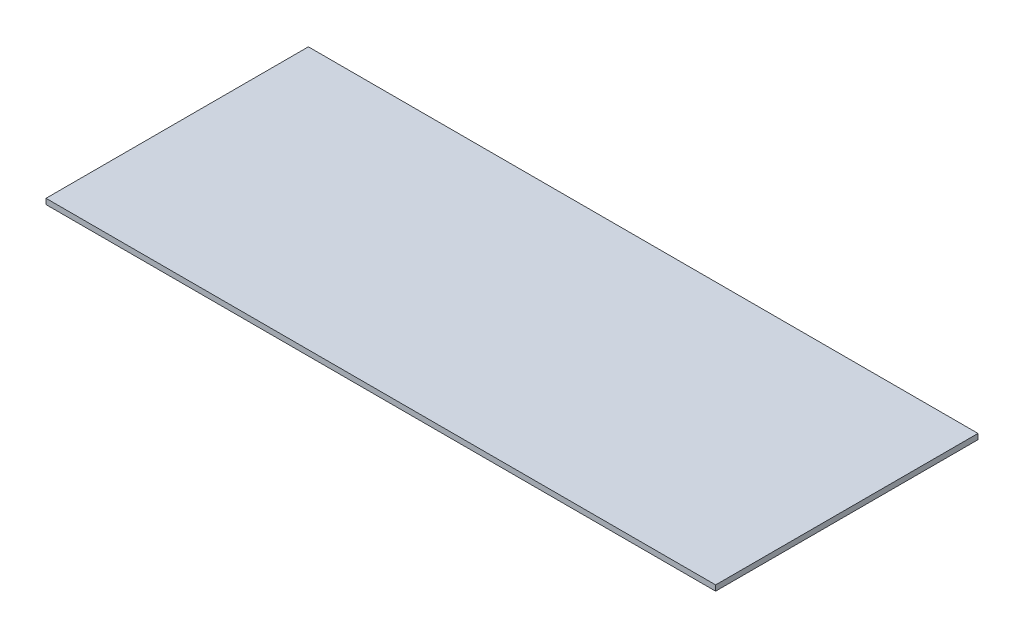
ISO-10303-21;
HEADER;
FILE_DESCRIPTION(('STEP AP214'),'2;1');
FILE_NAME('part.step','',(''),(''),'','','');
FILE_SCHEMA(('AUTOMOTIVE_DESIGN { 1 0 10303 214 1 1 1 1 }'));
ENDSEC;
DATA;
#1=APPLICATION_CONTEXT('core data for automotive mechanical design processes');
#2=APPLICATION_PROTOCOL_DEFINITION('international standard','automotive_design',2000,#1);
#3=PRODUCT_CONTEXT('',#1,'mechanical');
#4=PRODUCT('Part','Part','',(#3));
#5=PRODUCT_RELATED_PRODUCT_CATEGORY('part','',(#4));
#6=PRODUCT_DEFINITION_FORMATION('','',#4);
#7=PRODUCT_DEFINITION_CONTEXT('part definition',#1,'design');
#8=PRODUCT_DEFINITION('design','',#6,#7);
#9=PRODUCT_DEFINITION_SHAPE('','',#8);
#10=(LENGTH_UNIT() NAMED_UNIT(*) SI_UNIT(.MILLI.,.METRE.));
#11=(NAMED_UNIT(*) PLANE_ANGLE_UNIT() SI_UNIT($,.RADIAN.));
#12=(NAMED_UNIT(*) SI_UNIT($,.STERADIAN.) SOLID_ANGLE_UNIT());
#13=UNCERTAINTY_MEASURE_WITH_UNIT(LENGTH_MEASURE(1.E-05),#10,'distance_accuracy_value','');
#14=(GEOMETRIC_REPRESENTATION_CONTEXT(3) GLOBAL_UNCERTAINTY_ASSIGNED_CONTEXT((#13)) GLOBAL_UNIT_ASSIGNED_CONTEXT((#10,
#11,#12)) REPRESENTATION_CONTEXT('',''));
#15=CARTESIAN_POINT('',(0.,0.,0.));
#16=DIRECTION('',(0.,0.,1.));
#17=DIRECTION('',(1.,0.,0.));
#18=AXIS2_PLACEMENT_3D('',#15,#16,#17);
#19=CARTESIAN_POINT('',(122.5,2.,-48.));
#20=DIRECTION('',(-1.,0.,0.));
#21=DIRECTION('',(0.,0.,1.));
#22=AXIS2_PLACEMENT_3D('',#19,#20,#21);
#23=PLANE('',#22);
#24=DIRECTION('',(0.,0.,-1.));
#25=VECTOR('',#24,1.);
#26=CARTESIAN_POINT('',(122.5,0.,-48.));
#27=LINE('',#26,#25);
#28=CARTESIAN_POINT('',(122.5,0.,48.));
#29=VERTEX_POINT('',#28);
#30=CARTESIAN_POINT('',(122.5,0.,-48.));
#31=VERTEX_POINT('',#30);
#32=EDGE_CURVE('E97',#29,#31,#27,.T.);
#33=ORIENTED_EDGE('',*,*,#32,.T.);
#34=DIRECTION('',(0.,-1.,0.));
#35=VECTOR('',#34,1.);
#36=CARTESIAN_POINT('',(122.5,2.,-48.));
#37=LINE('',#36,#35);
#38=CARTESIAN_POINT('',(122.5,2.,-48.));
#39=VERTEX_POINT('',#38);
#40=EDGE_CURVE('E11',#39,#31,#37,.T.);
#41=ORIENTED_EDGE('',*,*,#40,.F.);
#42=DIRECTION('',(0.,0.,-1.));
#43=VECTOR('',#42,1.);
#44=CARTESIAN_POINT('',(122.5,2.,-48.));
#45=LINE('',#44,#43);
#46=CARTESIAN_POINT('',(122.5,2.,48.));
#47=VERTEX_POINT('',#46);
#48=EDGE_CURVE('E85',#47,#39,#45,.T.);
#49=ORIENTED_EDGE('',*,*,#48,.F.);
#50=DIRECTION('',(0.,-1.,0.));
#51=VECTOR('',#50,1.);
#52=CARTESIAN_POINT('',(122.5,2.,48.));
#53=LINE('',#52,#51);
#54=EDGE_CURVE('E93',#47,#29,#53,.T.);
#55=ORIENTED_EDGE('',*,*,#54,.T.);
#56=EDGE_LOOP('',(#33,#41,#49,#55));
#57=FACE_BOUND('',#56,.T.);
#58=ADVANCED_FACE('F34',(#57),#23,.F.);
#59=CARTESIAN_POINT('',(-122.5,2.,-48.));
#60=DIRECTION('',(0.,0.,1.));
#61=DIRECTION('',(1.,0.,0.));
#62=AXIS2_PLACEMENT_3D('',#59,#60,#61);
#63=PLANE('',#62);
#64=DIRECTION('',(-1.,0.,0.));
#65=VECTOR('',#64,1.);
#66=CARTESIAN_POINT('',(-122.5,0.,-48.));
#67=LINE('',#66,#65);
#68=CARTESIAN_POINT('',(-122.5,0.,-48.));
#69=VERTEX_POINT('',#68);
#70=EDGE_CURVE('E89',#31,#69,#67,.T.);
#71=ORIENTED_EDGE('',*,*,#70,.T.);
#72=DIRECTION('',(0.,-1.,0.));
#73=VECTOR('',#72,1.);
#74=CARTESIAN_POINT('',(-122.5,2.,-48.));
#75=LINE('',#74,#73);
#76=CARTESIAN_POINT('',(-122.5,2.,-48.));
#77=VERTEX_POINT('',#76);
#78=EDGE_CURVE('E42',#77,#69,#75,.T.);
#79=ORIENTED_EDGE('',*,*,#78,.F.);
#80=DIRECTION('',(-1.,0.,0.));
#81=VECTOR('',#80,1.);
#82=CARTESIAN_POINT('',(-122.5,2.,-48.));
#83=LINE('',#82,#81);
#84=EDGE_CURVE('E80',#39,#77,#83,.T.);
#85=ORIENTED_EDGE('',*,*,#84,.F.);
#86=ORIENTED_EDGE('',*,*,#40,.T.);
#87=EDGE_LOOP('',(#71,#79,#85,#86));
#88=FACE_BOUND('',#87,.T.);
#89=ADVANCED_FACE('F88',(#88),#63,.F.);
#90=CARTESIAN_POINT('',(-122.5,2.,-48.));
#91=DIRECTION('',(1.,0.,0.));
#92=DIRECTION('',(0.,0.,-1.));
#93=AXIS2_PLACEMENT_3D('',#90,#91,#92);
#94=PLANE('',#93);
#95=DIRECTION('',(0.,0.,1.));
#96=VECTOR('',#95,1.);
#97=CARTESIAN_POINT('',(-122.5,0.,-48.));
#98=LINE('',#97,#96);
#99=CARTESIAN_POINT('',(-122.5,0.,48.));
#100=VERTEX_POINT('',#99);
#101=EDGE_CURVE('E67',#69,#100,#98,.T.);
#102=ORIENTED_EDGE('',*,*,#101,.T.);
#103=DIRECTION('',(0.,-1.,0.));
#104=VECTOR('',#103,1.);
#105=CARTESIAN_POINT('',(-122.5,2.,48.));
#106=LINE('',#105,#104);
#107=CARTESIAN_POINT('',(-122.5,2.,48.));
#108=VERTEX_POINT('',#107);
#109=EDGE_CURVE('E90',#108,#100,#106,.T.);
#110=ORIENTED_EDGE('',*,*,#109,.F.);
#111=DIRECTION('',(0.,0.,1.));
#112=VECTOR('',#111,1.);
#113=CARTESIAN_POINT('',(-122.5,2.,-48.));
#114=LINE('',#113,#112);
#115=EDGE_CURVE('E83',#77,#108,#114,.T.);
#116=ORIENTED_EDGE('',*,*,#115,.F.);
#117=ORIENTED_EDGE('',*,*,#78,.T.);
#118=EDGE_LOOP('',(#102,#110,#116,#117));
#119=FACE_BOUND('',#118,.T.);
#120=ADVANCED_FACE('F91',(#119),#94,.F.);
#121=CARTESIAN_POINT('',(-122.5,2.,48.));
#122=DIRECTION('',(0.,0.,-1.));
#123=DIRECTION('',(-1.,0.,0.));
#124=AXIS2_PLACEMENT_3D('',#121,#122,#123);
#125=PLANE('',#124);
#126=DIRECTION('',(1.,0.,0.));
#127=VECTOR('',#126,1.);
#128=CARTESIAN_POINT('',(-122.5,0.,48.));
#129=LINE('',#128,#127);
#130=EDGE_CURVE('E73',#100,#29,#129,.T.);
#131=ORIENTED_EDGE('',*,*,#130,.T.);
#132=ORIENTED_EDGE('',*,*,#54,.F.);
#133=DIRECTION('',(1.,0.,0.));
#134=VECTOR('',#133,1.);
#135=CARTESIAN_POINT('',(-122.5,2.,48.));
#136=LINE('',#135,#134);
#137=EDGE_CURVE('E50',#108,#47,#136,.T.);
#138=ORIENTED_EDGE('',*,*,#137,.F.);
#139=ORIENTED_EDGE('',*,*,#109,.T.);
#140=EDGE_LOOP('',(#131,#132,#138,#139));
#141=FACE_BOUND('',#140,.T.);
#142=ADVANCED_FACE('F104',(#141),#125,.F.);
#143=CARTESIAN_POINT('',(0.,2.,0.));
#144=DIRECTION('',(0.,1.,0.));
#145=DIRECTION('',(0.,0.,1.));
#146=AXIS2_PLACEMENT_3D('',#143,#144,#145);
#147=PLANE('',#146);
#148=ORIENTED_EDGE('',*,*,#48,.T.);
#149=ORIENTED_EDGE('',*,*,#84,.T.);
#150=ORIENTED_EDGE('',*,*,#115,.T.);
#151=ORIENTED_EDGE('',*,*,#137,.T.);
#152=EDGE_LOOP('',(#148,#149,#150,#151));
#153=FACE_BOUND('',#152,.T.);
#154=ADVANCED_FACE('F81',(#153),#147,.T.);
#155=CARTESIAN_POINT('',(0.,0.,0.));
#156=DIRECTION('',(0.,1.,0.));
#157=DIRECTION('',(0.,0.,1.));
#158=AXIS2_PLACEMENT_3D('',#155,#156,#157);
#159=PLANE('',#158);
#160=ORIENTED_EDGE('',*,*,#32,.F.);
#161=ORIENTED_EDGE('',*,*,#130,.F.);
#162=ORIENTED_EDGE('',*,*,#101,.F.);
#163=ORIENTED_EDGE('',*,*,#70,.F.);
#164=EDGE_LOOP('',(#160,#161,#162,#163));
#165=FACE_BOUND('',#164,.T.);
#166=ADVANCED_FACE('F107',(#165),#159,.F.);
#167=CLOSED_SHELL('',(#58,#89,#120,#142,#154,#166));
#168=MANIFOLD_SOLID_BREP('B2',#167);
#169=ADVANCED_BREP_SHAPE_REPRESENTATION('',(#18,#168),#14);
#170=SHAPE_DEFINITION_REPRESENTATION(#9,#169);
ENDSEC;
END-ISO-10303-21;
